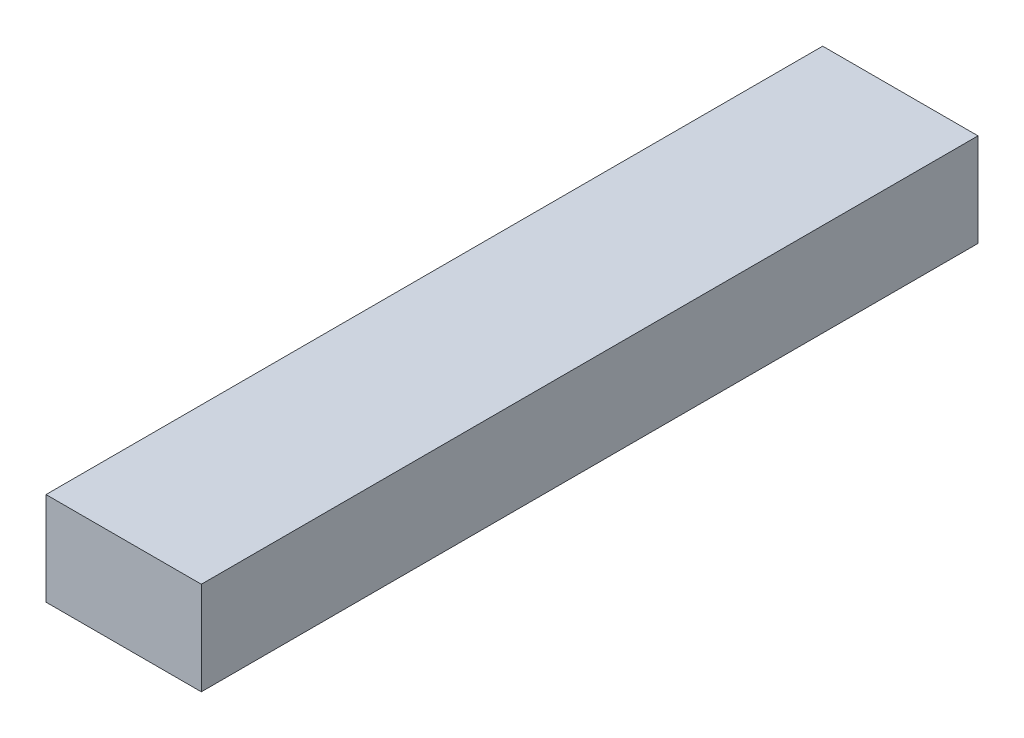
ISO-10303-21;
HEADER;
FILE_DESCRIPTION(('STEP AP214'),'2;1');
FILE_NAME('part.step','',(''),(''),'','','');
FILE_SCHEMA(('AUTOMOTIVE_DESIGN { 1 0 10303 214 1 1 1 1 }'));
ENDSEC;
DATA;
#1=APPLICATION_CONTEXT('core data for automotive mechanical design processes');
#2=APPLICATION_PROTOCOL_DEFINITION('international standard','automotive_design',2000,#1);
#3=PRODUCT_CONTEXT('',#1,'mechanical');
#4=PRODUCT('Part','Part','',(#3));
#5=PRODUCT_RELATED_PRODUCT_CATEGORY('part','',(#4));
#6=PRODUCT_DEFINITION_FORMATION('','',#4);
#7=PRODUCT_DEFINITION_CONTEXT('part definition',#1,'design');
#8=PRODUCT_DEFINITION('design','',#6,#7);
#9=PRODUCT_DEFINITION_SHAPE('','',#8);
#10=(LENGTH_UNIT() NAMED_UNIT(*) SI_UNIT(.MILLI.,.METRE.));
#11=(NAMED_UNIT(*) PLANE_ANGLE_UNIT() SI_UNIT($,.RADIAN.));
#12=(NAMED_UNIT(*) SI_UNIT($,.STERADIAN.) SOLID_ANGLE_UNIT());
#13=UNCERTAINTY_MEASURE_WITH_UNIT(LENGTH_MEASURE(1.E-05),#10,'distance_accuracy_value','');
#14=(GEOMETRIC_REPRESENTATION_CONTEXT(3) GLOBAL_UNCERTAINTY_ASSIGNED_CONTEXT((#13)) GLOBAL_UNIT_ASSIGNED_CONTEXT((#10,
#11,#12)) REPRESENTATION_CONTEXT('',''));
#15=CARTESIAN_POINT('',(0.,0.,0.));
#16=DIRECTION('',(0.,0.,1.));
#17=DIRECTION('',(1.,0.,0.));
#18=AXIS2_PLACEMENT_3D('',#15,#16,#17);
#19=CARTESIAN_POINT('',(0.5,0.3,2.5));
#20=DIRECTION('',(-1.,0.,0.));
#21=DIRECTION('',(0.,0.,1.));
#22=AXIS2_PLACEMENT_3D('',#19,#20,#21);
#23=PLANE('',#22);
#24=DIRECTION('',(0.,0.,-1.));
#25=VECTOR('',#24,1.);
#26=CARTESIAN_POINT('',(0.5,-0.3,2.5));
#27=LINE('',#26,#25);
#28=CARTESIAN_POINT('',(0.5,-0.3,2.5));
#29=VERTEX_POINT('',#28);
#30=CARTESIAN_POINT('',(0.5,-0.3,-2.5));
#31=VERTEX_POINT('',#30);
#32=EDGE_CURVE('E107',#29,#31,#27,.T.);
#33=ORIENTED_EDGE('',*,*,#32,.T.);
#34=DIRECTION('',(0.,-1.,0.));
#35=VECTOR('',#34,1.);
#36=CARTESIAN_POINT('',(0.5,0.3,-2.5));
#37=LINE('',#36,#35);
#38=CARTESIAN_POINT('',(0.5,0.3,-2.5));
#39=VERTEX_POINT('',#38);
#40=EDGE_CURVE('E11',#39,#31,#37,.T.);
#41=ORIENTED_EDGE('',*,*,#40,.F.);
#42=DIRECTION('',(0.,0.,-1.));
#43=VECTOR('',#42,1.);
#44=CARTESIAN_POINT('',(0.5,0.3,2.5));
#45=LINE('',#44,#43);
#46=CARTESIAN_POINT('',(0.5,0.3,2.5));
#47=VERTEX_POINT('',#46);
#48=EDGE_CURVE('E90',#47,#39,#45,.T.);
#49=ORIENTED_EDGE('',*,*,#48,.F.);
#50=DIRECTION('',(0.,-1.,0.));
#51=VECTOR('',#50,1.);
#52=CARTESIAN_POINT('',(0.5,0.3,2.5));
#53=LINE('',#52,#51);
#54=EDGE_CURVE('E103',#47,#29,#53,.T.);
#55=ORIENTED_EDGE('',*,*,#54,.T.);
#56=EDGE_LOOP('',(#33,#41,#49,#55));
#57=FACE_BOUND('',#56,.T.);
#58=ADVANCED_FACE('F38',(#57),#23,.F.);
#59=CARTESIAN_POINT('',(-0.5,0.3,-2.5));
#60=DIRECTION('',(0.,0.,1.));
#61=DIRECTION('',(1.,0.,0.));
#62=AXIS2_PLACEMENT_3D('',#59,#60,#61);
#63=PLANE('',#62);
#64=DIRECTION('',(-1.,0.,0.));
#65=VECTOR('',#64,1.);
#66=CARTESIAN_POINT('',(-0.5,-0.3,-2.5));
#67=LINE('',#66,#65);
#68=CARTESIAN_POINT('',(-0.5,-0.3,-2.5));
#69=VERTEX_POINT('',#68);
#70=EDGE_CURVE('E95',#31,#69,#67,.T.);
#71=ORIENTED_EDGE('',*,*,#70,.T.);
#72=DIRECTION('',(0.,-1.,0.));
#73=VECTOR('',#72,1.);
#74=CARTESIAN_POINT('',(-0.5,0.3,-2.5));
#75=LINE('',#74,#73);
#76=CARTESIAN_POINT('',(-0.5,0.3,-2.5));
#77=VERTEX_POINT('',#76);
#78=EDGE_CURVE('E47',#77,#69,#75,.T.);
#79=ORIENTED_EDGE('',*,*,#78,.F.);
#80=DIRECTION('',(-1.,0.,0.));
#81=VECTOR('',#80,1.);
#82=CARTESIAN_POINT('',(-0.5,0.3,-2.5));
#83=LINE('',#82,#81);
#84=EDGE_CURVE('E85',#39,#77,#83,.T.);
#85=ORIENTED_EDGE('',*,*,#84,.F.);
#86=ORIENTED_EDGE('',*,*,#40,.T.);
#87=EDGE_LOOP('',(#71,#79,#85,#86));
#88=FACE_BOUND('',#87,.T.);
#89=ADVANCED_FACE('F94',(#88),#63,.F.);
#90=CARTESIAN_POINT('',(-0.5,0.3,2.5));
#91=DIRECTION('',(1.,0.,0.));
#92=DIRECTION('',(0.,0.,-1.));
#93=AXIS2_PLACEMENT_3D('',#90,#91,#92);
#94=PLANE('',#93);
#95=DIRECTION('',(0.,0.,1.));
#96=VECTOR('',#95,1.);
#97=CARTESIAN_POINT('',(-0.5,-0.3,2.5));
#98=LINE('',#97,#96);
#99=CARTESIAN_POINT('',(-0.5,-0.3,2.5));
#100=VERTEX_POINT('',#99);
#101=EDGE_CURVE('E72',#69,#100,#98,.T.);
#102=ORIENTED_EDGE('',*,*,#101,.T.);
#103=DIRECTION('',(0.,-1.,0.));
#104=VECTOR('',#103,1.);
#105=CARTESIAN_POINT('',(-0.5,0.3,2.5));
#106=LINE('',#105,#104);
#107=CARTESIAN_POINT('',(-0.5,0.3,2.5));
#108=VERTEX_POINT('',#107);
#109=EDGE_CURVE('E97',#108,#100,#106,.T.);
#110=ORIENTED_EDGE('',*,*,#109,.F.);
#111=DIRECTION('',(0.,0.,1.));
#112=VECTOR('',#111,1.);
#113=CARTESIAN_POINT('',(-0.5,0.3,2.5));
#114=LINE('',#113,#112);
#115=EDGE_CURVE('E88',#77,#108,#114,.T.);
#116=ORIENTED_EDGE('',*,*,#115,.F.);
#117=ORIENTED_EDGE('',*,*,#78,.T.);
#118=EDGE_LOOP('',(#102,#110,#116,#117));
#119=FACE_BOUND('',#118,.T.);
#120=ADVANCED_FACE('F98',(#119),#94,.F.);
#121=CARTESIAN_POINT('',(-0.5,0.3,2.5));
#122=DIRECTION('',(0.,0.,-1.));
#123=DIRECTION('',(-1.,0.,0.));
#124=AXIS2_PLACEMENT_3D('',#121,#122,#123);
#125=PLANE('',#124);
#126=DIRECTION('',(1.,0.,0.));
#127=VECTOR('',#126,1.);
#128=CARTESIAN_POINT('',(-0.5,-0.3,2.5));
#129=LINE('',#128,#127);
#130=EDGE_CURVE('E78',#100,#29,#129,.T.);
#131=ORIENTED_EDGE('',*,*,#130,.T.);
#132=ORIENTED_EDGE('',*,*,#54,.F.);
#133=DIRECTION('',(1.,0.,0.));
#134=VECTOR('',#133,1.);
#135=CARTESIAN_POINT('',(-0.5,0.3,2.5));
#136=LINE('',#135,#134);
#137=EDGE_CURVE('E55',#108,#47,#136,.T.);
#138=ORIENTED_EDGE('',*,*,#137,.F.);
#139=ORIENTED_EDGE('',*,*,#109,.T.);
#140=EDGE_LOOP('',(#131,#132,#138,#139));
#141=FACE_BOUND('',#140,.T.);
#142=ADVANCED_FACE('F119',(#141),#125,.F.);
#143=CARTESIAN_POINT('',(0.,0.3,0.));
#144=DIRECTION('',(0.,-1.,0.));
#145=DIRECTION('',(0.,0.,-1.));
#146=AXIS2_PLACEMENT_3D('',#143,#144,#145);
#147=PLANE('',#146);
#148=ORIENTED_EDGE('',*,*,#48,.T.);
#149=ORIENTED_EDGE('',*,*,#84,.T.);
#150=ORIENTED_EDGE('',*,*,#115,.T.);
#151=ORIENTED_EDGE('',*,*,#137,.T.);
#152=EDGE_LOOP('',(#148,#149,#150,#151));
#153=FACE_BOUND('',#152,.T.);
#154=ADVANCED_FACE('F86',(#153),#147,.F.);
#155=CARTESIAN_POINT('',(0.,-0.3,0.));
#156=DIRECTION('',(0.,-1.,0.));
#157=DIRECTION('',(0.,0.,-1.));
#158=AXIS2_PLACEMENT_3D('',#155,#156,#157);
#159=PLANE('',#158);
#160=ORIENTED_EDGE('',*,*,#32,.F.);
#161=ORIENTED_EDGE('',*,*,#130,.F.);
#162=ORIENTED_EDGE('',*,*,#101,.F.);
#163=ORIENTED_EDGE('',*,*,#70,.F.);
#164=EDGE_LOOP('',(#160,#161,#162,#163));
#165=FACE_BOUND('',#164,.T.);
#166=ADVANCED_FACE('F122',(#165),#159,.T.);
#167=CLOSED_SHELL('',(#58,#89,#120,#142,#154,#166));
#168=MANIFOLD_SOLID_BREP('B2',#167);
#169=ADVANCED_BREP_SHAPE_REPRESENTATION('',(#18,#168),#14);
#170=SHAPE_DEFINITION_REPRESENTATION(#9,#169);
ENDSEC;
END-ISO-10303-21;
